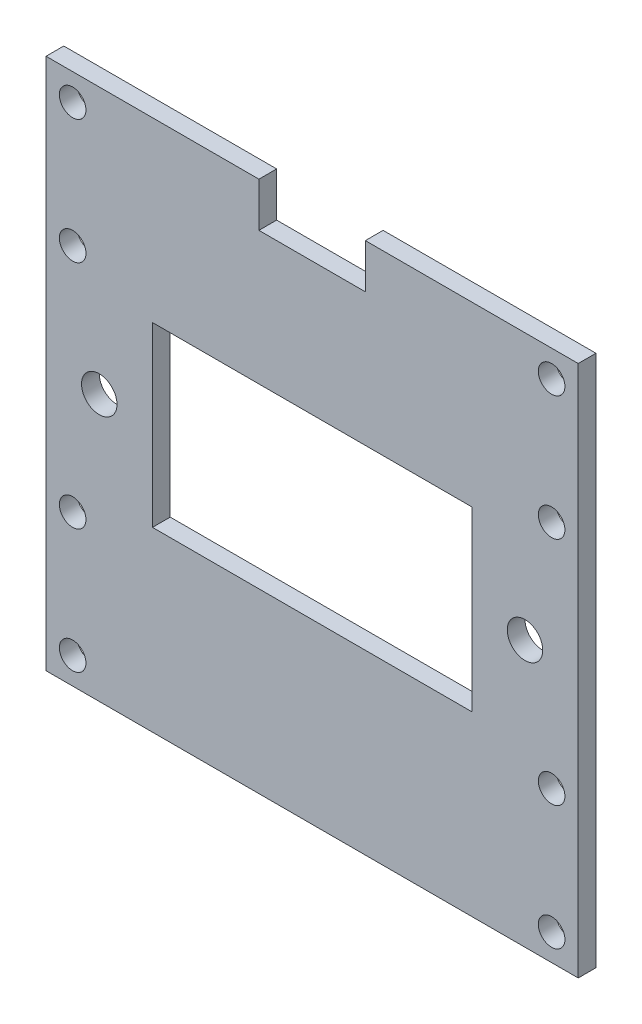
ISO-10303-21;
HEADER;
FILE_DESCRIPTION(('STEP AP214'),'2;1');
FILE_NAME('part.step','',(''),(''),'','','');
FILE_SCHEMA(('AUTOMOTIVE_DESIGN { 1 0 10303 214 1 1 1 1 }'));
ENDSEC;
DATA;
#1=APPLICATION_CONTEXT('core data for automotive mechanical design processes');
#2=APPLICATION_PROTOCOL_DEFINITION('international standard','automotive_design',2000,#1);
#3=PRODUCT_CONTEXT('',#1,'mechanical');
#4=PRODUCT('Part','Part','',(#3));
#5=PRODUCT_RELATED_PRODUCT_CATEGORY('part','',(#4));
#6=PRODUCT_DEFINITION_FORMATION('','',#4);
#7=PRODUCT_DEFINITION_CONTEXT('part definition',#1,'design');
#8=PRODUCT_DEFINITION('design','',#6,#7);
#9=PRODUCT_DEFINITION_SHAPE('','',#8);
#10=(LENGTH_UNIT() NAMED_UNIT(*) SI_UNIT(.MILLI.,.METRE.));
#11=(NAMED_UNIT(*) PLANE_ANGLE_UNIT() SI_UNIT($,.RADIAN.));
#12=(NAMED_UNIT(*) SI_UNIT($,.STERADIAN.) SOLID_ANGLE_UNIT());
#13=UNCERTAINTY_MEASURE_WITH_UNIT(LENGTH_MEASURE(1.E-05),#10,'distance_accuracy_value','');
#14=(GEOMETRIC_REPRESENTATION_CONTEXT(3) GLOBAL_UNCERTAINTY_ASSIGNED_CONTEXT((#13)) GLOBAL_UNIT_ASSIGNED_CONTEXT((#10,
#11,#12)) REPRESENTATION_CONTEXT('',''));
#15=CARTESIAN_POINT('',(0.,0.,0.));
#16=DIRECTION('',(0.,0.,1.));
#17=DIRECTION('',(1.,0.,0.));
#18=AXIS2_PLACEMENT_3D('',#15,#16,#17);
#19=CARTESIAN_POINT('',(0.,0.,2.));
#20=DIRECTION('',(0.,0.,-1.));
#21=DIRECTION('',(-1.,0.,0.));
#22=AXIS2_PLACEMENT_3D('',#19,#20,#21);
#23=PLANE('',#22);
#24=CARTESIAN_POINT('',(6.,30.,2.));
#25=DIRECTION('',(0.,0.,1.));
#26=DIRECTION('',(1.,0.,0.));
#27=AXIS2_PLACEMENT_3D('',#24,#25,#26);
#28=CIRCLE('',#27,2.);
#29=CARTESIAN_POINT('',(8.,30.,2.));
#30=VERTEX_POINT('',#29);
#31=EDGE_CURVE('E176',#30,#30,#28,.T.);
#32=ORIENTED_EDGE('',*,*,#31,.F.);
#33=EDGE_LOOP('',(#32));
#34=FACE_BOUND('',#33,.T.);
#35=CARTESIAN_POINT('',(3.,3.,2.));
#36=DIRECTION('',(0.,0.,1.));
#37=DIRECTION('',(1.,0.,0.));
#38=AXIS2_PLACEMENT_3D('',#35,#36,#37);
#39=CIRCLE('',#38,1.5);
#40=CARTESIAN_POINT('',(4.5,3.,2.));
#41=VERTEX_POINT('',#40);
#42=EDGE_CURVE('E192',#41,#41,#39,.T.);
#43=ORIENTED_EDGE('',*,*,#42,.F.);
#44=EDGE_LOOP('',(#43));
#45=FACE_BOUND('',#44,.T.);
#46=CARTESIAN_POINT('',(57.,3.,2.));
#47=DIRECTION('',(0.,0.,1.));
#48=DIRECTION('',(1.,0.,0.));
#49=AXIS2_PLACEMENT_3D('',#46,#47,#48);
#50=CIRCLE('',#49,1.5);
#51=CARTESIAN_POINT('',(58.5,3.,2.));
#52=VERTEX_POINT('',#51);
#53=EDGE_CURVE('E207',#52,#52,#50,.T.);
#54=ORIENTED_EDGE('',*,*,#53,.F.);
#55=EDGE_LOOP('',(#54));
#56=FACE_BOUND('',#55,.T.);
#57=CARTESIAN_POINT('',(57.,43.,2.));
#58=DIRECTION('',(0.,0.,1.));
#59=DIRECTION('',(1.,0.,0.));
#60=AXIS2_PLACEMENT_3D('',#57,#58,#59);
#61=CIRCLE('',#60,1.5);
#62=CARTESIAN_POINT('',(58.5,43.,2.));
#63=VERTEX_POINT('',#62);
#64=EDGE_CURVE('E223',#63,#63,#61,.T.);
#65=ORIENTED_EDGE('',*,*,#64,.F.);
#66=EDGE_LOOP('',(#65));
#67=FACE_BOUND('',#66,.T.);
#68=CARTESIAN_POINT('',(3.,43.,2.));
#69=DIRECTION('',(0.,0.,1.));
#70=DIRECTION('',(1.,0.,0.));
#71=AXIS2_PLACEMENT_3D('',#68,#69,#70);
#72=CIRCLE('',#71,1.5);
#73=CARTESIAN_POINT('',(4.5,43.,2.));
#74=VERTEX_POINT('',#73);
#75=EDGE_CURVE('E239',#74,#74,#72,.T.);
#76=ORIENTED_EDGE('',*,*,#75,.F.);
#77=EDGE_LOOP('',(#76));
#78=FACE_BOUND('',#77,.T.);
#79=DIRECTION('',(0.,-1.,0.));
#80=VECTOR('',#79,1.);
#81=CARTESIAN_POINT('',(0.,0.,2.));
#82=LINE('',#81,#80);
#83=CARTESIAN_POINT('',(0.,60.,2.));
#84=VERTEX_POINT('',#83);
#85=CARTESIAN_POINT('',(0.,0.,2.));
#86=VERTEX_POINT('',#85);
#87=EDGE_CURVE('E255',#84,#86,#82,.T.);
#88=ORIENTED_EDGE('',*,*,#87,.T.);
#89=DIRECTION('',(1.,0.,0.));
#90=VECTOR('',#89,1.);
#91=CARTESIAN_POINT('',(0.,0.,2.));
#92=LINE('',#91,#90);
#93=CARTESIAN_POINT('',(60.,0.,2.));
#94=VERTEX_POINT('',#93);
#95=EDGE_CURVE('E259',#86,#94,#92,.T.);
#96=ORIENTED_EDGE('',*,*,#95,.T.);
#97=DIRECTION('',(0.,1.,0.));
#98=VECTOR('',#97,1.);
#99=CARTESIAN_POINT('',(60.,0.,2.));
#100=LINE('',#99,#98);
#101=CARTESIAN_POINT('',(60.,60.,2.));
#102=VERTEX_POINT('',#101);
#103=EDGE_CURVE('E263',#94,#102,#100,.T.);
#104=ORIENTED_EDGE('',*,*,#103,.T.);
#105=DIRECTION('',(-1.,0.,0.));
#106=VECTOR('',#105,1.);
#107=CARTESIAN_POINT('',(36.,60.,2.));
#108=LINE('',#107,#106);
#109=CARTESIAN_POINT('',(36.,60.,2.));
#110=VERTEX_POINT('',#109);
#111=EDGE_CURVE('E266',#102,#110,#108,.T.);
#112=ORIENTED_EDGE('',*,*,#111,.T.);
#113=DIRECTION('',(0.,-1.,0.));
#114=VECTOR('',#113,1.);
#115=CARTESIAN_POINT('',(36.,60.,2.));
#116=LINE('',#115,#114);
#117=CARTESIAN_POINT('',(36.,55.,2.));
#118=VERTEX_POINT('',#117);
#119=EDGE_CURVE('E269',#110,#118,#116,.T.);
#120=ORIENTED_EDGE('',*,*,#119,.T.);
#121=DIRECTION('',(-1.,0.,0.));
#122=VECTOR('',#121,1.);
#123=CARTESIAN_POINT('',(24.,55.,2.));
#124=LINE('',#123,#122);
#125=CARTESIAN_POINT('',(24.,55.,2.));
#126=VERTEX_POINT('',#125);
#127=EDGE_CURVE('E272',#118,#126,#124,.T.);
#128=ORIENTED_EDGE('',*,*,#127,.T.);
#129=DIRECTION('',(0.,1.,0.));
#130=VECTOR('',#129,1.);
#131=CARTESIAN_POINT('',(24.,60.,2.));
#132=LINE('',#131,#130);
#133=CARTESIAN_POINT('',(24.,60.,2.));
#134=VERTEX_POINT('',#133);
#135=EDGE_CURVE('E275',#126,#134,#132,.T.);
#136=ORIENTED_EDGE('',*,*,#135,.T.);
#137=DIRECTION('',(-1.,0.,0.));
#138=VECTOR('',#137,1.);
#139=CARTESIAN_POINT('',(0.,60.,2.));
#140=LINE('',#139,#138);
#141=EDGE_CURVE('E278',#134,#84,#140,.T.);
#142=ORIENTED_EDGE('',*,*,#141,.T.);
#143=EDGE_LOOP('',(#88,#96,#104,#112,#120,#128,#136,#142));
#144=FACE_BOUND('',#143,.T.);
#145=CARTESIAN_POINT('',(3.,57.,2.));
#146=DIRECTION('',(0.,0.,1.));
#147=DIRECTION('',(1.,0.,0.));
#148=AXIS2_PLACEMENT_3D('',#145,#146,#147);
#149=CIRCLE('',#148,1.5);
#150=CARTESIAN_POINT('',(4.5,57.,2.));
#151=VERTEX_POINT('',#150);
#152=EDGE_CURVE('E247',#151,#151,#149,.T.);
#153=ORIENTED_EDGE('',*,*,#152,.F.);
#154=EDGE_LOOP('',(#153));
#155=FACE_BOUND('',#154,.T.);
#156=CARTESIAN_POINT('',(57.,57.,2.));
#157=DIRECTION('',(0.,0.,1.));
#158=DIRECTION('',(1.,0.,0.));
#159=AXIS2_PLACEMENT_3D('',#156,#157,#158);
#160=CIRCLE('',#159,1.5);
#161=CARTESIAN_POINT('',(58.5,57.,2.));
#162=VERTEX_POINT('',#161);
#163=EDGE_CURVE('E231',#162,#162,#160,.T.);
#164=ORIENTED_EDGE('',*,*,#163,.F.);
#165=EDGE_LOOP('',(#164));
#166=FACE_BOUND('',#165,.T.);
#167=CARTESIAN_POINT('',(57.,17.,2.));
#168=DIRECTION('',(0.,0.,1.));
#169=DIRECTION('',(1.,0.,0.));
#170=AXIS2_PLACEMENT_3D('',#167,#168,#169);
#171=CIRCLE('',#170,1.5);
#172=CARTESIAN_POINT('',(58.5,17.,2.));
#173=VERTEX_POINT('',#172);
#174=EDGE_CURVE('E215',#173,#173,#171,.T.);
#175=ORIENTED_EDGE('',*,*,#174,.F.);
#176=EDGE_LOOP('',(#175));
#177=FACE_BOUND('',#176,.T.);
#178=CARTESIAN_POINT('',(3.,17.,2.));
#179=DIRECTION('',(0.,0.,1.));
#180=DIRECTION('',(1.,0.,0.));
#181=AXIS2_PLACEMENT_3D('',#178,#179,#180);
#182=CIRCLE('',#181,1.5);
#183=CARTESIAN_POINT('',(4.5,17.,2.));
#184=VERTEX_POINT('',#183);
#185=EDGE_CURVE('E199',#184,#184,#182,.T.);
#186=ORIENTED_EDGE('',*,*,#185,.F.);
#187=EDGE_LOOP('',(#186));
#188=FACE_BOUND('',#187,.T.);
#189=DIRECTION('',(0.,-1.,0.));
#190=VECTOR('',#189,1.);
#191=CARTESIAN_POINT('',(12.,40.,2.));
#192=LINE('',#191,#190);
#193=CARTESIAN_POINT('',(12.,40.,2.));
#194=VERTEX_POINT('',#193);
#195=CARTESIAN_POINT('',(12.,20.,2.));
#196=VERTEX_POINT('',#195);
#197=EDGE_CURVE('E139',#194,#196,#192,.T.);
#198=ORIENTED_EDGE('',*,*,#197,.F.);
#199=DIRECTION('',(-1.,0.,0.));
#200=VECTOR('',#199,1.);
#201=CARTESIAN_POINT('',(12.,40.,2.));
#202=LINE('',#201,#200);
#203=CARTESIAN_POINT('',(48.,40.,2.));
#204=VERTEX_POINT('',#203);
#205=EDGE_CURVE('E168',#204,#194,#202,.T.);
#206=ORIENTED_EDGE('',*,*,#205,.F.);
#207=DIRECTION('',(0.,1.,0.));
#208=VECTOR('',#207,1.);
#209=CARTESIAN_POINT('',(48.,40.,2.));
#210=LINE('',#209,#208);
#211=CARTESIAN_POINT('',(48.,20.,2.));
#212=VERTEX_POINT('',#211);
#213=EDGE_CURVE('E162',#212,#204,#210,.T.);
#214=ORIENTED_EDGE('',*,*,#213,.F.);
#215=DIRECTION('',(1.,0.,0.));
#216=VECTOR('',#215,1.);
#217=CARTESIAN_POINT('',(12.,20.,2.));
#218=LINE('',#217,#216);
#219=EDGE_CURVE('E148',#196,#212,#218,.T.);
#220=ORIENTED_EDGE('',*,*,#219,.F.);
#221=EDGE_LOOP('',(#198,#206,#214,#220));
#222=FACE_BOUND('',#221,.T.);
#223=CARTESIAN_POINT('',(54.,30.,2.));
#224=DIRECTION('',(0.,0.,1.));
#225=DIRECTION('',(1.,0.,0.));
#226=AXIS2_PLACEMENT_3D('',#223,#224,#225);
#227=CIRCLE('',#226,2.);
#228=CARTESIAN_POINT('',(56.,30.,2.));
#229=VERTEX_POINT('',#228);
#230=EDGE_CURVE('E420',#229,#229,#227,.T.);
#231=ORIENTED_EDGE('',*,*,#230,.F.);
#232=EDGE_LOOP('',(#231));
#233=FACE_BOUND('',#232,.T.);
#234=ADVANCED_FACE('F49',(#34,#45,#56,#67,#78,#144,#155,#166,#177,#188,#222,#233),#23,.F.);
#235=CARTESIAN_POINT('',(0.,0.,0.));
#236=DIRECTION('',(0.,0.,-1.));
#237=DIRECTION('',(-1.,0.,0.));
#238=AXIS2_PLACEMENT_3D('',#235,#236,#237);
#239=PLANE('',#238);
#240=CARTESIAN_POINT('',(6.,30.,0.));
#241=DIRECTION('',(0.,0.,1.));
#242=DIRECTION('',(1.,0.,0.));
#243=AXIS2_PLACEMENT_3D('',#240,#241,#242);
#244=CIRCLE('',#243,2.);
#245=CARTESIAN_POINT('',(8.,30.,0.));
#246=VERTEX_POINT('',#245);
#247=EDGE_CURVE('E424',#246,#246,#244,.T.);
#248=ORIENTED_EDGE('',*,*,#247,.T.);
#249=EDGE_LOOP('',(#248));
#250=FACE_BOUND('',#249,.T.);
#251=CARTESIAN_POINT('',(3.,3.,0.));
#252=DIRECTION('',(0.,0.,1.));
#253=DIRECTION('',(1.,0.,0.));
#254=AXIS2_PLACEMENT_3D('',#251,#252,#253);
#255=CIRCLE('',#254,1.5);
#256=CARTESIAN_POINT('',(4.5,3.,0.));
#257=VERTEX_POINT('',#256);
#258=EDGE_CURVE('E157',#257,#257,#255,.T.);
#259=ORIENTED_EDGE('',*,*,#258,.T.);
#260=EDGE_LOOP('',(#259));
#261=FACE_BOUND('',#260,.T.);
#262=CARTESIAN_POINT('',(57.,3.,0.));
#263=DIRECTION('',(0.,0.,1.));
#264=DIRECTION('',(1.,0.,0.));
#265=AXIS2_PLACEMENT_3D('',#262,#263,#264);
#266=CIRCLE('',#265,1.5);
#267=CARTESIAN_POINT('',(58.5,3.,0.));
#268=VERTEX_POINT('',#267);
#269=EDGE_CURVE('E203',#268,#268,#266,.T.);
#270=ORIENTED_EDGE('',*,*,#269,.T.);
#271=EDGE_LOOP('',(#270));
#272=FACE_BOUND('',#271,.T.);
#273=CARTESIAN_POINT('',(57.,43.,0.));
#274=DIRECTION('',(0.,0.,1.));
#275=DIRECTION('',(1.,0.,0.));
#276=AXIS2_PLACEMENT_3D('',#273,#274,#275);
#277=CIRCLE('',#276,1.5);
#278=CARTESIAN_POINT('',(58.5,43.,0.));
#279=VERTEX_POINT('',#278);
#280=EDGE_CURVE('E219',#279,#279,#277,.T.);
#281=ORIENTED_EDGE('',*,*,#280,.T.);
#282=EDGE_LOOP('',(#281));
#283=FACE_BOUND('',#282,.T.);
#284=CARTESIAN_POINT('',(3.,43.,0.));
#285=DIRECTION('',(0.,0.,1.));
#286=DIRECTION('',(1.,0.,0.));
#287=AXIS2_PLACEMENT_3D('',#284,#285,#286);
#288=CIRCLE('',#287,1.5);
#289=CARTESIAN_POINT('',(4.5,43.,0.));
#290=VERTEX_POINT('',#289);
#291=EDGE_CURVE('E235',#290,#290,#288,.T.);
#292=ORIENTED_EDGE('',*,*,#291,.T.);
#293=EDGE_LOOP('',(#292));
#294=FACE_BOUND('',#293,.T.);
#295=DIRECTION('',(0.,-1.,0.));
#296=VECTOR('',#295,1.);
#297=CARTESIAN_POINT('',(0.,0.,0.));
#298=LINE('',#297,#296);
#299=CARTESIAN_POINT('',(0.,60.,0.));
#300=VERTEX_POINT('',#299);
#301=CARTESIAN_POINT('',(0.,0.,0.));
#302=VERTEX_POINT('',#301);
#303=EDGE_CURVE('E251',#300,#302,#298,.T.);
#304=ORIENTED_EDGE('',*,*,#303,.F.);
#305=DIRECTION('',(-1.,0.,0.));
#306=VECTOR('',#305,1.);
#307=CARTESIAN_POINT('',(0.,60.,0.));
#308=LINE('',#307,#306);
#309=CARTESIAN_POINT('',(24.,60.,0.));
#310=VERTEX_POINT('',#309);
#311=EDGE_CURVE('E260',#310,#300,#308,.T.);
#312=ORIENTED_EDGE('',*,*,#311,.F.);
#313=DIRECTION('',(0.,1.,0.));
#314=VECTOR('',#313,1.);
#315=CARTESIAN_POINT('',(24.,60.,0.));
#316=LINE('',#315,#314);
#317=CARTESIAN_POINT('',(24.,55.,0.));
#318=VERTEX_POINT('',#317);
#319=EDGE_CURVE('E300',#318,#310,#316,.T.);
#320=ORIENTED_EDGE('',*,*,#319,.F.);
#321=DIRECTION('',(-1.,0.,0.));
#322=VECTOR('',#321,1.);
#323=CARTESIAN_POINT('',(24.,55.,0.));
#324=LINE('',#323,#322);
#325=CARTESIAN_POINT('',(36.,55.,0.));
#326=VERTEX_POINT('',#325);
#327=EDGE_CURVE('E297',#326,#318,#324,.T.);
#328=ORIENTED_EDGE('',*,*,#327,.F.);
#329=DIRECTION('',(0.,-1.,0.));
#330=VECTOR('',#329,1.);
#331=CARTESIAN_POINT('',(36.,60.,0.));
#332=LINE('',#331,#330);
#333=CARTESIAN_POINT('',(36.,60.,0.));
#334=VERTEX_POINT('',#333);
#335=EDGE_CURVE('E294',#334,#326,#332,.T.);
#336=ORIENTED_EDGE('',*,*,#335,.F.);
#337=DIRECTION('',(-1.,0.,0.));
#338=VECTOR('',#337,1.);
#339=CARTESIAN_POINT('',(36.,60.,0.));
#340=LINE('',#339,#338);
#341=CARTESIAN_POINT('',(60.,60.,0.));
#342=VERTEX_POINT('',#341);
#343=EDGE_CURVE('E291',#342,#334,#340,.T.);
#344=ORIENTED_EDGE('',*,*,#343,.F.);
#345=DIRECTION('',(0.,1.,0.));
#346=VECTOR('',#345,1.);
#347=CARTESIAN_POINT('',(60.,0.,0.));
#348=LINE('',#347,#346);
#349=CARTESIAN_POINT('',(60.,0.,0.));
#350=VERTEX_POINT('',#349);
#351=EDGE_CURVE('E288',#350,#342,#348,.T.);
#352=ORIENTED_EDGE('',*,*,#351,.F.);
#353=DIRECTION('',(1.,0.,0.));
#354=VECTOR('',#353,1.);
#355=CARTESIAN_POINT('',(36.,0.,0.));
#356=LINE('',#355,#354);
#357=EDGE_CURVE('E285',#302,#350,#356,.T.);
#358=ORIENTED_EDGE('',*,*,#357,.F.);
#359=EDGE_LOOP('',(#304,#312,#320,#328,#336,#344,#352,#358));
#360=FACE_BOUND('',#359,.T.);
#361=CARTESIAN_POINT('',(3.,57.,0.));
#362=DIRECTION('',(0.,0.,1.));
#363=DIRECTION('',(1.,0.,0.));
#364=AXIS2_PLACEMENT_3D('',#361,#362,#363);
#365=CIRCLE('',#364,1.5);
#366=CARTESIAN_POINT('',(4.5,57.,0.));
#367=VERTEX_POINT('',#366);
#368=EDGE_CURVE('E243',#367,#367,#365,.T.);
#369=ORIENTED_EDGE('',*,*,#368,.T.);
#370=EDGE_LOOP('',(#369));
#371=FACE_BOUND('',#370,.T.);
#372=CARTESIAN_POINT('',(57.,57.,0.));
#373=DIRECTION('',(0.,0.,1.));
#374=DIRECTION('',(1.,0.,0.));
#375=AXIS2_PLACEMENT_3D('',#372,#373,#374);
#376=CIRCLE('',#375,1.5);
#377=CARTESIAN_POINT('',(58.5,57.,0.));
#378=VERTEX_POINT('',#377);
#379=EDGE_CURVE('E227',#378,#378,#376,.T.);
#380=ORIENTED_EDGE('',*,*,#379,.T.);
#381=EDGE_LOOP('',(#380));
#382=FACE_BOUND('',#381,.T.);
#383=CARTESIAN_POINT('',(57.,17.,0.));
#384=DIRECTION('',(0.,0.,1.));
#385=DIRECTION('',(1.,0.,0.));
#386=AXIS2_PLACEMENT_3D('',#383,#384,#385);
#387=CIRCLE('',#386,1.5);
#388=CARTESIAN_POINT('',(58.5,17.,0.));
#389=VERTEX_POINT('',#388);
#390=EDGE_CURVE('E211',#389,#389,#387,.T.);
#391=ORIENTED_EDGE('',*,*,#390,.T.);
#392=EDGE_LOOP('',(#391));
#393=FACE_BOUND('',#392,.T.);
#394=CARTESIAN_POINT('',(3.,17.,0.));
#395=DIRECTION('',(0.,0.,1.));
#396=DIRECTION('',(1.,0.,0.));
#397=AXIS2_PLACEMENT_3D('',#394,#395,#396);
#398=CIRCLE('',#397,1.5);
#399=CARTESIAN_POINT('',(4.5,17.,0.));
#400=VERTEX_POINT('',#399);
#401=EDGE_CURVE('E196',#400,#400,#398,.T.);
#402=ORIENTED_EDGE('',*,*,#401,.T.);
#403=EDGE_LOOP('',(#402));
#404=FACE_BOUND('',#403,.T.);
#405=DIRECTION('',(-1.,0.,0.));
#406=VECTOR('',#405,1.);
#407=CARTESIAN_POINT('',(12.,40.,0.));
#408=LINE('',#407,#406);
#409=CARTESIAN_POINT('',(48.,40.,0.));
#410=VERTEX_POINT('',#409);
#411=CARTESIAN_POINT('',(12.,40.,0.));
#412=VERTEX_POINT('',#411);
#413=EDGE_CURVE('E149',#410,#412,#408,.T.);
#414=ORIENTED_EDGE('',*,*,#413,.T.);
#415=DIRECTION('',(0.,-1.,0.));
#416=VECTOR('',#415,1.);
#417=CARTESIAN_POINT('',(12.,40.,0.));
#418=LINE('',#417,#416);
#419=CARTESIAN_POINT('',(12.,20.,0.));
#420=VERTEX_POINT('',#419);
#421=EDGE_CURVE('E73',#412,#420,#418,.T.);
#422=ORIENTED_EDGE('',*,*,#421,.T.);
#423=DIRECTION('',(1.,0.,0.));
#424=VECTOR('',#423,1.);
#425=CARTESIAN_POINT('',(12.,20.,0.));
#426=LINE('',#425,#424);
#427=CARTESIAN_POINT('',(48.,20.,0.));
#428=VERTEX_POINT('',#427);
#429=EDGE_CURVE('E155',#420,#428,#426,.T.);
#430=ORIENTED_EDGE('',*,*,#429,.T.);
#431=DIRECTION('',(0.,1.,0.));
#432=VECTOR('',#431,1.);
#433=CARTESIAN_POINT('',(48.,40.,0.));
#434=LINE('',#433,#432);
#435=EDGE_CURVE('E179',#428,#410,#434,.T.);
#436=ORIENTED_EDGE('',*,*,#435,.T.);
#437=EDGE_LOOP('',(#414,#422,#430,#436));
#438=FACE_BOUND('',#437,.T.);
#439=CARTESIAN_POINT('',(54.,30.,0.));
#440=DIRECTION('',(0.,0.,1.));
#441=DIRECTION('',(1.,0.,0.));
#442=AXIS2_PLACEMENT_3D('',#439,#440,#441);
#443=CIRCLE('',#442,2.);
#444=CARTESIAN_POINT('',(56.,30.,0.));
#445=VERTEX_POINT('',#444);
#446=EDGE_CURVE('E417',#445,#445,#443,.T.);
#447=ORIENTED_EDGE('',*,*,#446,.T.);
#448=EDGE_LOOP('',(#447));
#449=FACE_BOUND('',#448,.T.);
#450=ADVANCED_FACE('F339',(#250,#261,#272,#283,#294,#360,#371,#382,#393,#404,#438,#449),#239,.T.);
#451=CARTESIAN_POINT('',(0.,0.,2.));
#452=DIRECTION('',(1.,0.,0.));
#453=DIRECTION('',(0.,0.,-1.));
#454=AXIS2_PLACEMENT_3D('',#451,#452,#453);
#455=PLANE('',#454);
#456=ORIENTED_EDGE('',*,*,#303,.T.);
#457=DIRECTION('',(0.,0.,-1.));
#458=VECTOR('',#457,1.);
#459=CARTESIAN_POINT('',(0.,0.,2.));
#460=LINE('',#459,#458);
#461=EDGE_CURVE('E13',#86,#302,#460,.T.);
#462=ORIENTED_EDGE('',*,*,#461,.F.);
#463=ORIENTED_EDGE('',*,*,#87,.F.);
#464=DIRECTION('',(0.,0.,-1.));
#465=VECTOR('',#464,1.);
#466=CARTESIAN_POINT('',(0.,60.,2.));
#467=LINE('',#466,#465);
#468=EDGE_CURVE('E281',#84,#300,#467,.T.);
#469=ORIENTED_EDGE('',*,*,#468,.T.);
#470=EDGE_LOOP('',(#456,#462,#463,#469));
#471=FACE_BOUND('',#470,.T.);
#472=ADVANCED_FACE('F51',(#471),#455,.F.);
#473=CARTESIAN_POINT('',(36.,0.,2.));
#474=DIRECTION('',(0.,1.,0.));
#475=DIRECTION('',(0.,0.,1.));
#476=AXIS2_PLACEMENT_3D('',#473,#474,#475);
#477=PLANE('',#476);
#478=ORIENTED_EDGE('',*,*,#357,.T.);
#479=DIRECTION('',(0.,0.,-1.));
#480=VECTOR('',#479,1.);
#481=CARTESIAN_POINT('',(60.,0.,2.));
#482=LINE('',#481,#480);
#483=EDGE_CURVE('E58',#94,#350,#482,.T.);
#484=ORIENTED_EDGE('',*,*,#483,.F.);
#485=ORIENTED_EDGE('',*,*,#95,.F.);
#486=ORIENTED_EDGE('',*,*,#461,.T.);
#487=EDGE_LOOP('',(#478,#484,#485,#486));
#488=FACE_BOUND('',#487,.T.);
#489=ADVANCED_FACE('F357',(#488),#477,.F.);
#490=CARTESIAN_POINT('',(60.,0.,2.));
#491=DIRECTION('',(-1.,0.,0.));
#492=DIRECTION('',(0.,0.,1.));
#493=AXIS2_PLACEMENT_3D('',#490,#491,#492);
#494=PLANE('',#493);
#495=ORIENTED_EDGE('',*,*,#351,.T.);
#496=DIRECTION('',(0.,0.,-1.));
#497=VECTOR('',#496,1.);
#498=CARTESIAN_POINT('',(60.,60.,2.));
#499=LINE('',#498,#497);
#500=EDGE_CURVE('E324',#102,#342,#499,.T.);
#501=ORIENTED_EDGE('',*,*,#500,.F.);
#502=ORIENTED_EDGE('',*,*,#103,.F.);
#503=ORIENTED_EDGE('',*,*,#483,.T.);
#504=EDGE_LOOP('',(#495,#501,#502,#503));
#505=FACE_BOUND('',#504,.T.);
#506=ADVANCED_FACE('F333',(#505),#494,.F.);
#507=CARTESIAN_POINT('',(36.,60.,2.));
#508=DIRECTION('',(0.,-1.,0.));
#509=DIRECTION('',(0.,0.,-1.));
#510=AXIS2_PLACEMENT_3D('',#507,#508,#509);
#511=PLANE('',#510);
#512=ORIENTED_EDGE('',*,*,#343,.T.);
#513=DIRECTION('',(0.,0.,-1.));
#514=VECTOR('',#513,1.);
#515=CARTESIAN_POINT('',(36.,60.,2.));
#516=LINE('',#515,#514);
#517=EDGE_CURVE('E320',#110,#334,#516,.T.);
#518=ORIENTED_EDGE('',*,*,#517,.F.);
#519=ORIENTED_EDGE('',*,*,#111,.F.);
#520=ORIENTED_EDGE('',*,*,#500,.T.);
#521=EDGE_LOOP('',(#512,#518,#519,#520));
#522=FACE_BOUND('',#521,.T.);
#523=ADVANCED_FACE('F345',(#522),#511,.F.);
#524=CARTESIAN_POINT('',(36.,60.,2.));
#525=DIRECTION('',(1.,0.,0.));
#526=DIRECTION('',(0.,0.,-1.));
#527=AXIS2_PLACEMENT_3D('',#524,#525,#526);
#528=PLANE('',#527);
#529=ORIENTED_EDGE('',*,*,#335,.T.);
#530=DIRECTION('',(0.,0.,-1.));
#531=VECTOR('',#530,1.);
#532=CARTESIAN_POINT('',(36.,55.,2.));
#533=LINE('',#532,#531);
#534=EDGE_CURVE('E316',#118,#326,#533,.T.);
#535=ORIENTED_EDGE('',*,*,#534,.F.);
#536=ORIENTED_EDGE('',*,*,#119,.F.);
#537=ORIENTED_EDGE('',*,*,#517,.T.);
#538=EDGE_LOOP('',(#529,#535,#536,#537));
#539=FACE_BOUND('',#538,.T.);
#540=ADVANCED_FACE('F349',(#539),#528,.F.);
#541=CARTESIAN_POINT('',(24.,55.,2.));
#542=DIRECTION('',(0.,-1.,0.));
#543=DIRECTION('',(0.,0.,-1.));
#544=AXIS2_PLACEMENT_3D('',#541,#542,#543);
#545=PLANE('',#544);
#546=ORIENTED_EDGE('',*,*,#327,.T.);
#547=DIRECTION('',(0.,0.,-1.));
#548=VECTOR('',#547,1.);
#549=CARTESIAN_POINT('',(24.,55.,2.));
#550=LINE('',#549,#548);
#551=EDGE_CURVE('E312',#126,#318,#550,.T.);
#552=ORIENTED_EDGE('',*,*,#551,.F.);
#553=ORIENTED_EDGE('',*,*,#127,.F.);
#554=ORIENTED_EDGE('',*,*,#534,.T.);
#555=EDGE_LOOP('',(#546,#552,#553,#554));
#556=FACE_BOUND('',#555,.T.);
#557=ADVANCED_FACE('F370',(#556),#545,.F.);
#558=CARTESIAN_POINT('',(24.,60.,2.));
#559=DIRECTION('',(-1.,0.,0.));
#560=DIRECTION('',(0.,0.,1.));
#561=AXIS2_PLACEMENT_3D('',#558,#559,#560);
#562=PLANE('',#561);
#563=ORIENTED_EDGE('',*,*,#319,.T.);
#564=DIRECTION('',(0.,0.,-1.));
#565=VECTOR('',#564,1.);
#566=CARTESIAN_POINT('',(24.,60.,2.));
#567=LINE('',#566,#565);
#568=EDGE_CURVE('E308',#134,#310,#567,.T.);
#569=ORIENTED_EDGE('',*,*,#568,.F.);
#570=ORIENTED_EDGE('',*,*,#135,.F.);
#571=ORIENTED_EDGE('',*,*,#551,.T.);
#572=EDGE_LOOP('',(#563,#569,#570,#571));
#573=FACE_BOUND('',#572,.T.);
#574=ADVANCED_FACE('F368',(#573),#562,.F.);
#575=CARTESIAN_POINT('',(0.,60.,2.));
#576=DIRECTION('',(0.,-1.,0.));
#577=DIRECTION('',(0.,0.,-1.));
#578=AXIS2_PLACEMENT_3D('',#575,#576,#577);
#579=PLANE('',#578);
#580=ORIENTED_EDGE('',*,*,#311,.T.);
#581=ORIENTED_EDGE('',*,*,#468,.F.);
#582=ORIENTED_EDGE('',*,*,#141,.F.);
#583=ORIENTED_EDGE('',*,*,#568,.T.);
#584=EDGE_LOOP('',(#580,#581,#582,#583));
#585=FACE_BOUND('',#584,.T.);
#586=ADVANCED_FACE('F363',(#585),#579,.F.);
#587=CARTESIAN_POINT('',(3.,57.,2.));
#588=DIRECTION('',(0.,0.,-1.));
#589=DIRECTION('',(-1.,0.,0.));
#590=AXIS2_PLACEMENT_3D('',#587,#588,#589);
#591=CYLINDRICAL_SURFACE('',#590,1.5);
#592=ORIENTED_EDGE('',*,*,#152,.T.);
#593=EDGE_LOOP('',(#592));
#594=FACE_BOUND('',#593,.T.);
#595=ORIENTED_EDGE('',*,*,#368,.F.);
#596=EDGE_LOOP('',(#595));
#597=FACE_BOUND('',#596,.T.);
#598=ADVANCED_FACE('F390',(#594,#597),#591,.F.);
#599=CARTESIAN_POINT('',(3.,43.,2.));
#600=DIRECTION('',(0.,0.,-1.));
#601=DIRECTION('',(-1.,0.,0.));
#602=AXIS2_PLACEMENT_3D('',#599,#600,#601);
#603=CYLINDRICAL_SURFACE('',#602,1.5);
#604=ORIENTED_EDGE('',*,*,#75,.T.);
#605=EDGE_LOOP('',(#604));
#606=FACE_BOUND('',#605,.T.);
#607=ORIENTED_EDGE('',*,*,#291,.F.);
#608=EDGE_LOOP('',(#607));
#609=FACE_BOUND('',#608,.T.);
#610=ADVANCED_FACE('F397',(#606,#609),#603,.F.);
#611=CARTESIAN_POINT('',(57.,57.,2.));
#612=DIRECTION('',(0.,0.,-1.));
#613=DIRECTION('',(-1.,0.,0.));
#614=AXIS2_PLACEMENT_3D('',#611,#612,#613);
#615=CYLINDRICAL_SURFACE('',#614,1.5);
#616=ORIENTED_EDGE('',*,*,#163,.T.);
#617=EDGE_LOOP('',(#616));
#618=FACE_BOUND('',#617,.T.);
#619=ORIENTED_EDGE('',*,*,#379,.F.);
#620=EDGE_LOOP('',(#619));
#621=FACE_BOUND('',#620,.T.);
#622=ADVANCED_FACE('F402',(#618,#621),#615,.F.);
#623=CARTESIAN_POINT('',(57.,43.,2.));
#624=DIRECTION('',(0.,0.,-1.));
#625=DIRECTION('',(-1.,0.,0.));
#626=AXIS2_PLACEMENT_3D('',#623,#624,#625);
#627=CYLINDRICAL_SURFACE('',#626,1.5);
#628=ORIENTED_EDGE('',*,*,#64,.T.);
#629=EDGE_LOOP('',(#628));
#630=FACE_BOUND('',#629,.T.);
#631=ORIENTED_EDGE('',*,*,#280,.F.);
#632=EDGE_LOOP('',(#631));
#633=FACE_BOUND('',#632,.T.);
#634=ADVANCED_FACE('F470',(#630,#633),#627,.F.);
#635=CARTESIAN_POINT('',(57.,17.,2.));
#636=DIRECTION('',(0.,0.,-1.));
#637=DIRECTION('',(-1.,0.,0.));
#638=AXIS2_PLACEMENT_3D('',#635,#636,#637);
#639=CYLINDRICAL_SURFACE('',#638,1.5);
#640=ORIENTED_EDGE('',*,*,#174,.T.);
#641=EDGE_LOOP('',(#640));
#642=FACE_BOUND('',#641,.T.);
#643=ORIENTED_EDGE('',*,*,#390,.F.);
#644=EDGE_LOOP('',(#643));
#645=FACE_BOUND('',#644,.T.);
#646=ADVANCED_FACE('F466',(#642,#645),#639,.F.);
#647=CARTESIAN_POINT('',(57.,3.,2.));
#648=DIRECTION('',(0.,0.,-1.));
#649=DIRECTION('',(-1.,0.,0.));
#650=AXIS2_PLACEMENT_3D('',#647,#648,#649);
#651=CYLINDRICAL_SURFACE('',#650,1.5);
#652=ORIENTED_EDGE('',*,*,#53,.T.);
#653=EDGE_LOOP('',(#652));
#654=FACE_BOUND('',#653,.T.);
#655=ORIENTED_EDGE('',*,*,#269,.F.);
#656=EDGE_LOOP('',(#655));
#657=FACE_BOUND('',#656,.T.);
#658=ADVANCED_FACE('F462',(#654,#657),#651,.F.);
#659=CARTESIAN_POINT('',(3.,17.,2.));
#660=DIRECTION('',(0.,0.,-1.));
#661=DIRECTION('',(-1.,0.,0.));
#662=AXIS2_PLACEMENT_3D('',#659,#660,#661);
#663=CYLINDRICAL_SURFACE('',#662,1.5);
#664=ORIENTED_EDGE('',*,*,#185,.T.);
#665=EDGE_LOOP('',(#664));
#666=FACE_BOUND('',#665,.T.);
#667=ORIENTED_EDGE('',*,*,#401,.F.);
#668=EDGE_LOOP('',(#667));
#669=FACE_BOUND('',#668,.T.);
#670=ADVANCED_FACE('F458',(#666,#669),#663,.F.);
#671=CARTESIAN_POINT('',(3.,3.,2.));
#672=DIRECTION('',(0.,0.,-1.));
#673=DIRECTION('',(-1.,0.,0.));
#674=AXIS2_PLACEMENT_3D('',#671,#672,#673);
#675=CYLINDRICAL_SURFACE('',#674,1.5);
#676=ORIENTED_EDGE('',*,*,#42,.T.);
#677=EDGE_LOOP('',(#676));
#678=FACE_BOUND('',#677,.T.);
#679=ORIENTED_EDGE('',*,*,#258,.F.);
#680=EDGE_LOOP('',(#679));
#681=FACE_BOUND('',#680,.T.);
#682=ADVANCED_FACE('F455',(#678,#681),#675,.F.);
#683=CARTESIAN_POINT('',(12.,40.,2.));
#684=DIRECTION('',(1.,0.,0.));
#685=DIRECTION('',(0.,1.,0.));
#686=AXIS2_PLACEMENT_3D('',#683,#684,#685);
#687=PLANE('',#686);
#688=ORIENTED_EDGE('',*,*,#421,.F.);
#689=DIRECTION('',(0.,0.,-1.));
#690=VECTOR('',#689,1.);
#691=CARTESIAN_POINT('',(12.,40.,2.));
#692=LINE('',#691,#690);
#693=EDGE_CURVE('E143',#194,#412,#692,.T.);
#694=ORIENTED_EDGE('',*,*,#693,.F.);
#695=ORIENTED_EDGE('',*,*,#197,.T.);
#696=DIRECTION('',(0.,0.,-1.));
#697=VECTOR('',#696,1.);
#698=CARTESIAN_POINT('',(12.,20.,2.));
#699=LINE('',#698,#697);
#700=EDGE_CURVE('E142',#196,#420,#699,.T.);
#701=ORIENTED_EDGE('',*,*,#700,.T.);
#702=EDGE_LOOP('',(#688,#694,#695,#701));
#703=FACE_BOUND('',#702,.T.);
#704=ADVANCED_FACE('F141',(#703),#687,.T.);
#705=CARTESIAN_POINT('',(12.,20.,2.));
#706=DIRECTION('',(0.,1.,0.));
#707=DIRECTION('',(0.,0.,1.));
#708=AXIS2_PLACEMENT_3D('',#705,#706,#707);
#709=PLANE('',#708);
#710=ORIENTED_EDGE('',*,*,#429,.F.);
#711=ORIENTED_EDGE('',*,*,#700,.F.);
#712=ORIENTED_EDGE('',*,*,#219,.T.);
#713=DIRECTION('',(0.,0.,-1.));
#714=VECTOR('',#713,1.);
#715=CARTESIAN_POINT('',(48.,20.,2.));
#716=LINE('',#715,#714);
#717=EDGE_CURVE('E158',#212,#428,#716,.T.);
#718=ORIENTED_EDGE('',*,*,#717,.T.);
#719=EDGE_LOOP('',(#710,#711,#712,#718));
#720=FACE_BOUND('',#719,.T.);
#721=ADVANCED_FACE('F152',(#720),#709,.T.);
#722=CARTESIAN_POINT('',(48.,40.,2.));
#723=DIRECTION('',(-1.,0.,0.));
#724=DIRECTION('',(0.,0.,1.));
#725=AXIS2_PLACEMENT_3D('',#722,#723,#724);
#726=PLANE('',#725);
#727=ORIENTED_EDGE('',*,*,#435,.F.);
#728=ORIENTED_EDGE('',*,*,#717,.F.);
#729=ORIENTED_EDGE('',*,*,#213,.T.);
#730=DIRECTION('',(0.,0.,-1.));
#731=VECTOR('',#730,1.);
#732=CARTESIAN_POINT('',(48.,40.,2.));
#733=LINE('',#732,#731);
#734=EDGE_CURVE('E65',#204,#410,#733,.T.);
#735=ORIENTED_EDGE('',*,*,#734,.T.);
#736=EDGE_LOOP('',(#727,#728,#729,#735));
#737=FACE_BOUND('',#736,.T.);
#738=ADVANCED_FACE('F445',(#737),#726,.T.);
#739=CARTESIAN_POINT('',(12.,40.,2.));
#740=DIRECTION('',(0.,-1.,0.));
#741=DIRECTION('',(0.,0.,-1.));
#742=AXIS2_PLACEMENT_3D('',#739,#740,#741);
#743=PLANE('',#742);
#744=ORIENTED_EDGE('',*,*,#413,.F.);
#745=ORIENTED_EDGE('',*,*,#734,.F.);
#746=ORIENTED_EDGE('',*,*,#205,.T.);
#747=ORIENTED_EDGE('',*,*,#693,.T.);
#748=EDGE_LOOP('',(#744,#745,#746,#747));
#749=FACE_BOUND('',#748,.T.);
#750=ADVANCED_FACE('F436',(#749),#743,.T.);
#751=CARTESIAN_POINT('',(6.,30.,2.));
#752=DIRECTION('',(0.,0.,-1.));
#753=DIRECTION('',(-1.,0.,0.));
#754=AXIS2_PLACEMENT_3D('',#751,#752,#753);
#755=CYLINDRICAL_SURFACE('',#754,2.);
#756=ORIENTED_EDGE('',*,*,#31,.T.);
#757=EDGE_LOOP('',(#756));
#758=FACE_BOUND('',#757,.T.);
#759=ORIENTED_EDGE('',*,*,#247,.F.);
#760=EDGE_LOOP('',(#759));
#761=FACE_BOUND('',#760,.T.);
#762=ADVANCED_FACE('F433',(#758,#761),#755,.F.);
#763=CARTESIAN_POINT('',(54.,30.,2.));
#764=DIRECTION('',(0.,0.,-1.));
#765=DIRECTION('',(-1.,0.,0.));
#766=AXIS2_PLACEMENT_3D('',#763,#764,#765);
#767=CYLINDRICAL_SURFACE('',#766,2.);
#768=ORIENTED_EDGE('',*,*,#230,.T.);
#769=EDGE_LOOP('',(#768));
#770=FACE_BOUND('',#769,.T.);
#771=ORIENTED_EDGE('',*,*,#446,.F.);
#772=EDGE_LOOP('',(#771));
#773=FACE_BOUND('',#772,.T.);
#774=ADVANCED_FACE('F435',(#770,#773),#767,.F.);
#775=CLOSED_SHELL('',(#234,#450,#472,#489,#506,#523,#540,#557,#574,#586,#598,#610,#622,#634,
#646,#658,#670,#682,#704,#721,#738,#750,#762,#774));
#776=MANIFOLD_SOLID_BREP('B2',#775);
#777=ADVANCED_BREP_SHAPE_REPRESENTATION('',(#18,#776),#14);
#778=SHAPE_DEFINITION_REPRESENTATION(#9,#777);
ENDSEC;
END-ISO-10303-21;
